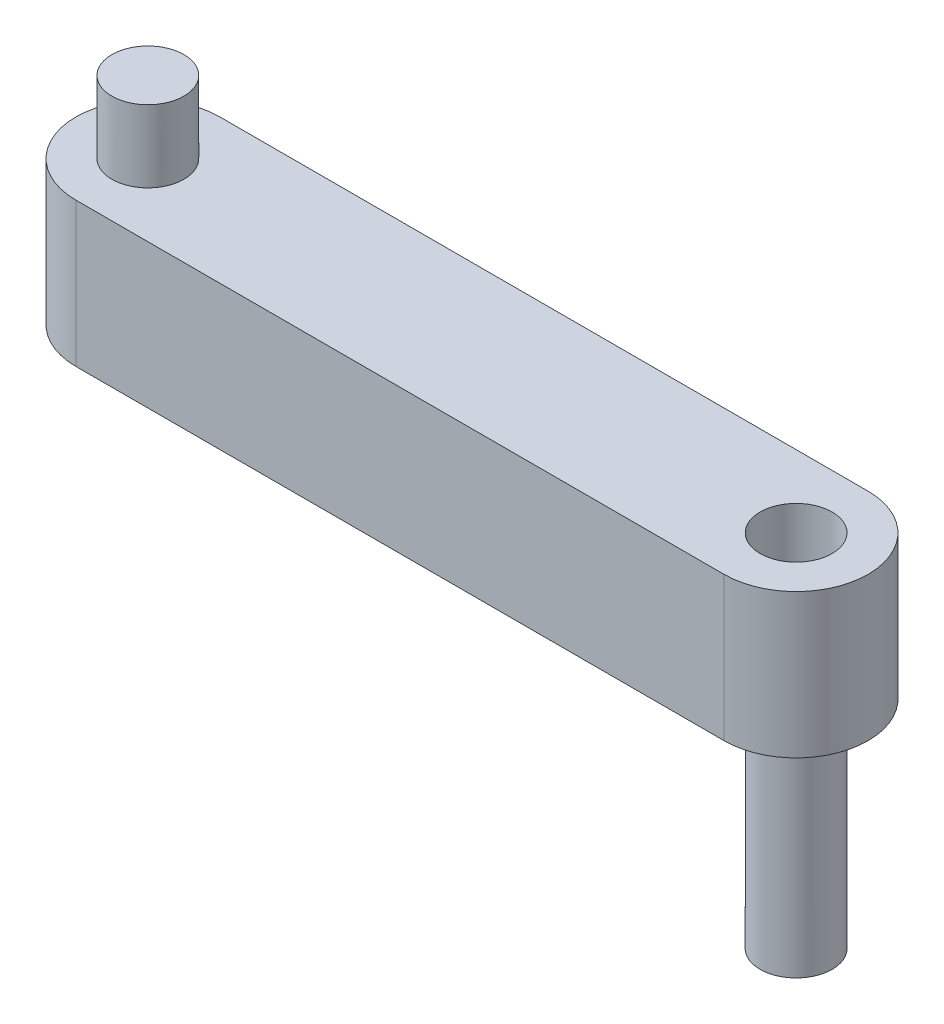
ISO-10303-21;
HEADER;
FILE_DESCRIPTION(('STEP AP214'),'2;1');
FILE_NAME('part.step','',(''),(''),'','','');
FILE_SCHEMA(('AUTOMOTIVE_DESIGN { 1 0 10303 214 1 1 1 1 }'));
ENDSEC;
DATA;
#1=APPLICATION_CONTEXT('core data for automotive mechanical design processes');
#2=APPLICATION_PROTOCOL_DEFINITION('international standard','automotive_design',2000,#1);
#3=PRODUCT_CONTEXT('',#1,'mechanical');
#4=PRODUCT('Part','Part','',(#3));
#5=PRODUCT_RELATED_PRODUCT_CATEGORY('part','',(#4));
#6=PRODUCT_DEFINITION_FORMATION('','',#4);
#7=PRODUCT_DEFINITION_CONTEXT('part definition',#1,'design');
#8=PRODUCT_DEFINITION('design','',#6,#7);
#9=PRODUCT_DEFINITION_SHAPE('','',#8);
#10=(LENGTH_UNIT() NAMED_UNIT(*) SI_UNIT(.MILLI.,.METRE.));
#11=(NAMED_UNIT(*) PLANE_ANGLE_UNIT() SI_UNIT($,.RADIAN.));
#12=(NAMED_UNIT(*) SI_UNIT($,.STERADIAN.) SOLID_ANGLE_UNIT());
#13=UNCERTAINTY_MEASURE_WITH_UNIT(LENGTH_MEASURE(1.E-05),#10,'distance_accuracy_value','');
#14=(GEOMETRIC_REPRESENTATION_CONTEXT(3) GLOBAL_UNCERTAINTY_ASSIGNED_CONTEXT((#13)) GLOBAL_UNIT_ASSIGNED_CONTEXT((#10,
#11,#12)) REPRESENTATION_CONTEXT('',''));
#15=CARTESIAN_POINT('',(0.,0.,0.));
#16=DIRECTION('',(0.,0.,1.));
#17=DIRECTION('',(1.,0.,0.));
#18=AXIS2_PLACEMENT_3D('',#15,#16,#17);
#19=CARTESIAN_POINT('',(-22.5,10.,0.));
#20=DIRECTION('',(0.,-1.,0.));
#21=DIRECTION('',(0.,0.,-1.));
#22=AXIS2_PLACEMENT_3D('',#19,#20,#21);
#23=PLANE('',#22);
#24=CARTESIAN_POINT('',(22.5,10.,0.));
#25=DIRECTION('',(0.,1.,0.));
#26=DIRECTION('',(0.,0.,1.));
#27=AXIS2_PLACEMENT_3D('',#24,#25,#26);
#28=CIRCLE('',#27,2.5);
#29=CARTESIAN_POINT('',(22.5,10.,2.5));
#30=VERTEX_POINT('',#29);
#31=EDGE_CURVE('E252',#30,#30,#28,.T.);
#32=ORIENTED_EDGE('',*,*,#31,.F.);
#33=EDGE_LOOP('',(#32));
#34=FACE_BOUND('',#33,.T.);
#35=CARTESIAN_POINT('',(-22.5,10.,0.));
#36=DIRECTION('',(0.,1.,0.));
#37=DIRECTION('',(0.,0.,-1.));
#38=AXIS2_PLACEMENT_3D('',#35,#36,#37);
#39=CIRCLE('',#38,5.);
#40=CARTESIAN_POINT('',(-22.5,10.,-5.));
#41=VERTEX_POINT('',#40);
#42=CARTESIAN_POINT('',(-22.5,10.,5.));
#43=VERTEX_POINT('',#42);
#44=EDGE_CURVE('E89',#41,#43,#39,.T.);
#45=ORIENTED_EDGE('',*,*,#44,.T.);
#46=DIRECTION('',(1.,0.,0.));
#47=VECTOR('',#46,1.);
#48=CARTESIAN_POINT('',(-22.5,10.,5.));
#49=LINE('',#48,#47);
#50=CARTESIAN_POINT('',(22.5,10.,5.));
#51=VERTEX_POINT('',#50);
#52=EDGE_CURVE('E84',#43,#51,#49,.T.);
#53=ORIENTED_EDGE('',*,*,#52,.T.);
#54=CARTESIAN_POINT('',(22.5,10.,0.));
#55=DIRECTION('',(0.,1.,0.));
#56=DIRECTION('',(0.,0.,1.));
#57=AXIS2_PLACEMENT_3D('',#54,#55,#56);
#58=CIRCLE('',#57,5.);
#59=CARTESIAN_POINT('',(22.5,10.,-5.));
#60=VERTEX_POINT('',#59);
#61=EDGE_CURVE('E87',#51,#60,#58,.T.);
#62=ORIENTED_EDGE('',*,*,#61,.T.);
#63=DIRECTION('',(-1.,0.,0.));
#64=VECTOR('',#63,1.);
#65=CARTESIAN_POINT('',(-22.5,10.,-5.));
#66=LINE('',#65,#64);
#67=EDGE_CURVE('E53',#60,#41,#66,.T.);
#68=ORIENTED_EDGE('',*,*,#67,.T.);
#69=EDGE_LOOP('',(#45,#53,#62,#68));
#70=FACE_BOUND('',#69,.T.);
#71=CARTESIAN_POINT('',(-22.5,10.,0.));
#72=DIRECTION('',(0.,-1.,0.));
#73=DIRECTION('',(0.,0.,-1.));
#74=AXIS2_PLACEMENT_3D('',#71,#72,#73);
#75=CIRCLE('',#74,2.5);
#76=CARTESIAN_POINT('',(-22.5,10.,-2.5));
#77=VERTEX_POINT('',#76);
#78=EDGE_CURVE('E45',#77,#77,#75,.F.);
#79=ORIENTED_EDGE('',*,*,#78,.F.);
#80=EDGE_LOOP('',(#79));
#81=FACE_BOUND('',#80,.T.);
#82=ADVANCED_FACE('F36',(#34,#70,#81),#23,.F.);
#83=CARTESIAN_POINT('',(-22.5,10.,0.));
#84=DIRECTION('',(0.,-1.,0.));
#85=DIRECTION('',(0.,0.,-1.));
#86=AXIS2_PLACEMENT_3D('',#83,#84,#85);
#87=CYLINDRICAL_SURFACE('',#86,5.);
#88=CARTESIAN_POINT('',(-22.5,0.,0.));
#89=DIRECTION('',(0.,1.,0.));
#90=DIRECTION('',(0.,0.,-1.));
#91=AXIS2_PLACEMENT_3D('',#88,#89,#90);
#92=CIRCLE('',#91,5.);
#93=CARTESIAN_POINT('',(-22.5,0.,-5.));
#94=VERTEX_POINT('',#93);
#95=CARTESIAN_POINT('',(-22.5,0.,5.));
#96=VERTEX_POINT('',#95);
#97=EDGE_CURVE('E104',#94,#96,#92,.T.);
#98=ORIENTED_EDGE('',*,*,#97,.T.);
#99=DIRECTION('',(0.,-1.,0.));
#100=VECTOR('',#99,1.);
#101=CARTESIAN_POINT('',(-22.5,10.,5.));
#102=LINE('',#101,#100);
#103=EDGE_CURVE('E95',#43,#96,#102,.T.);
#104=ORIENTED_EDGE('',*,*,#103,.F.);
#105=ORIENTED_EDGE('',*,*,#44,.F.);
#106=DIRECTION('',(0.,-1.,0.));
#107=VECTOR('',#106,1.);
#108=CARTESIAN_POINT('',(-22.5,10.,-5.));
#109=LINE('',#108,#107);
#110=EDGE_CURVE('E100',#41,#94,#109,.T.);
#111=ORIENTED_EDGE('',*,*,#110,.T.);
#112=EDGE_LOOP('',(#98,#104,#105,#111));
#113=FACE_BOUND('',#112,.T.);
#114=ADVANCED_FACE('F38',(#113),#87,.T.);
#115=CARTESIAN_POINT('',(-22.5,10.,5.));
#116=DIRECTION('',(0.,0.,-1.));
#117=DIRECTION('',(-1.,0.,0.));
#118=AXIS2_PLACEMENT_3D('',#115,#116,#117);
#119=PLANE('',#118);
#120=DIRECTION('',(1.,0.,0.));
#121=VECTOR('',#120,1.);
#122=CARTESIAN_POINT('',(-22.5,0.,5.));
#123=LINE('',#122,#121);
#124=CARTESIAN_POINT('',(22.5,0.,5.));
#125=VERTEX_POINT('',#124);
#126=EDGE_CURVE('E94',#96,#125,#123,.T.);
#127=ORIENTED_EDGE('',*,*,#126,.T.);
#128=DIRECTION('',(0.,-1.,0.));
#129=VECTOR('',#128,1.);
#130=CARTESIAN_POINT('',(22.5,10.,5.));
#131=LINE('',#130,#129);
#132=EDGE_CURVE('E92',#51,#125,#131,.T.);
#133=ORIENTED_EDGE('',*,*,#132,.F.);
#134=ORIENTED_EDGE('',*,*,#52,.F.);
#135=ORIENTED_EDGE('',*,*,#103,.T.);
#136=EDGE_LOOP('',(#127,#133,#134,#135));
#137=FACE_BOUND('',#136,.T.);
#138=ADVANCED_FACE('F93',(#137),#119,.F.);
#139=CARTESIAN_POINT('',(22.5,10.,0.));
#140=DIRECTION('',(0.,-1.,0.));
#141=DIRECTION('',(0.,0.,-1.));
#142=AXIS2_PLACEMENT_3D('',#139,#140,#141);
#143=CYLINDRICAL_SURFACE('',#142,5.);
#144=CARTESIAN_POINT('',(22.5,0.,0.));
#145=DIRECTION('',(0.,1.,0.));
#146=DIRECTION('',(0.,0.,1.));
#147=AXIS2_PLACEMENT_3D('',#144,#145,#146);
#148=CIRCLE('',#147,5.);
#149=CARTESIAN_POINT('',(22.5,0.,-5.));
#150=VERTEX_POINT('',#149);
#151=EDGE_CURVE('E70',#125,#150,#148,.T.);
#152=ORIENTED_EDGE('',*,*,#151,.T.);
#153=DIRECTION('',(0.,-1.,0.));
#154=VECTOR('',#153,1.);
#155=CARTESIAN_POINT('',(22.5,10.,-5.));
#156=LINE('',#155,#154);
#157=EDGE_CURVE('E96',#60,#150,#156,.T.);
#158=ORIENTED_EDGE('',*,*,#157,.F.);
#159=ORIENTED_EDGE('',*,*,#61,.F.);
#160=ORIENTED_EDGE('',*,*,#132,.T.);
#161=EDGE_LOOP('',(#152,#158,#159,#160));
#162=FACE_BOUND('',#161,.T.);
#163=ADVANCED_FACE('F98',(#162),#143,.T.);
#164=CARTESIAN_POINT('',(-22.5,10.,-5.));
#165=DIRECTION('',(0.,0.,1.));
#166=DIRECTION('',(1.,0.,0.));
#167=AXIS2_PLACEMENT_3D('',#164,#165,#166);
#168=PLANE('',#167);
#169=DIRECTION('',(-1.,0.,0.));
#170=VECTOR('',#169,1.);
#171=CARTESIAN_POINT('',(-22.5,0.,-5.));
#172=LINE('',#171,#170);
#173=EDGE_CURVE('E76',#150,#94,#172,.T.);
#174=ORIENTED_EDGE('',*,*,#173,.T.);
#175=ORIENTED_EDGE('',*,*,#110,.F.);
#176=ORIENTED_EDGE('',*,*,#67,.F.);
#177=ORIENTED_EDGE('',*,*,#157,.T.);
#178=EDGE_LOOP('',(#174,#175,#176,#177));
#179=FACE_BOUND('',#178,.T.);
#180=ADVANCED_FACE('F131',(#179),#168,.F.);
#181=CARTESIAN_POINT('',(-22.5,0.,0.));
#182=DIRECTION('',(0.,-1.,0.));
#183=DIRECTION('',(0.,0.,-1.));
#184=AXIS2_PLACEMENT_3D('',#181,#182,#183);
#185=PLANE('',#184);
#186=CARTESIAN_POINT('',(-22.5,0.,0.));
#187=DIRECTION('',(0.,-1.,0.));
#188=DIRECTION('',(0.,0.,-1.));
#189=AXIS2_PLACEMENT_3D('',#186,#187,#188);
#190=CIRCLE('',#189,2.5);
#191=CARTESIAN_POINT('',(-22.5,0.,-2.5));
#192=VERTEX_POINT('',#191);
#193=EDGE_CURVE('E251',#192,#192,#190,.T.);
#194=ORIENTED_EDGE('',*,*,#193,.F.);
#195=EDGE_LOOP('',(#194));
#196=FACE_BOUND('',#195,.T.);
#197=CARTESIAN_POINT('',(22.5,0.,0.));
#198=DIRECTION('',(0.,-1.,0.));
#199=DIRECTION('',(0.,0.,-1.));
#200=AXIS2_PLACEMENT_3D('',#197,#198,#199);
#201=CIRCLE('',#200,2.5);
#202=CARTESIAN_POINT('',(22.5,0.,-2.5));
#203=VERTEX_POINT('',#202);
#204=EDGE_CURVE('E11',#203,#203,#201,.T.);
#205=ORIENTED_EDGE('',*,*,#204,.F.);
#206=EDGE_LOOP('',(#205));
#207=FACE_BOUND('',#206,.T.);
#208=ORIENTED_EDGE('',*,*,#97,.F.);
#209=ORIENTED_EDGE('',*,*,#173,.F.);
#210=ORIENTED_EDGE('',*,*,#151,.F.);
#211=ORIENTED_EDGE('',*,*,#126,.F.);
#212=EDGE_LOOP('',(#208,#209,#210,#211));
#213=FACE_BOUND('',#212,.T.);
#214=ADVANCED_FACE('F128',(#196,#207,#213),#185,.T.);
#215=CARTESIAN_POINT('',(-22.5,15.,0.));
#216=DIRECTION('',(0.,-1.,0.));
#217=DIRECTION('',(0.,0.,-1.));
#218=AXIS2_PLACEMENT_3D('',#215,#216,#217);
#219=CYLINDRICAL_SURFACE('',#218,2.5);
#220=CARTESIAN_POINT('',(-22.5,15.,0.));
#221=DIRECTION('',(0.,1.,0.));
#222=DIRECTION('',(0.,0.,1.));
#223=AXIS2_PLACEMENT_3D('',#220,#221,#222);
#224=CIRCLE('',#223,2.5);
#225=CARTESIAN_POINT('',(-22.5,15.,2.5));
#226=VERTEX_POINT('',#225);
#227=EDGE_CURVE('E107',#226,#226,#224,.T.);
#228=ORIENTED_EDGE('',*,*,#227,.F.);
#229=EDGE_LOOP('',(#228));
#230=FACE_BOUND('',#229,.T.);
#231=ORIENTED_EDGE('',*,*,#78,.T.);
#232=EDGE_LOOP('',(#231));
#233=FACE_BOUND('',#232,.T.);
#234=ADVANCED_FACE('F116',(#230,#233),#219,.T.);
#235=CARTESIAN_POINT('',(-22.5,15.,0.));
#236=DIRECTION('',(0.,1.,0.));
#237=DIRECTION('',(0.,0.,1.));
#238=AXIS2_PLACEMENT_3D('',#235,#236,#237);
#239=PLANE('',#238);
#240=ORIENTED_EDGE('',*,*,#227,.T.);
#241=EDGE_LOOP('',(#240));
#242=FACE_BOUND('',#241,.T.);
#243=ADVANCED_FACE('F161',(#242),#239,.T.);
#244=CARTESIAN_POINT('',(22.5,-15.,0.));
#245=DIRECTION('',(0.,1.,0.));
#246=DIRECTION('',(0.,0.,1.));
#247=AXIS2_PLACEMENT_3D('',#244,#245,#246);
#248=CYLINDRICAL_SURFACE('',#247,2.5);
#249=ORIENTED_EDGE('',*,*,#204,.T.);
#250=EDGE_LOOP('',(#249));
#251=FACE_BOUND('',#250,.T.);
#252=CARTESIAN_POINT('',(22.5,-15.,0.));
#253=DIRECTION('',(0.,1.,0.));
#254=DIRECTION('',(0.,0.,1.));
#255=AXIS2_PLACEMENT_3D('',#252,#253,#254);
#256=CIRCLE('',#255,2.5);
#257=CARTESIAN_POINT('',(22.5,-15.,2.5));
#258=VERTEX_POINT('',#257);
#259=EDGE_CURVE('E261',#258,#258,#256,.T.);
#260=ORIENTED_EDGE('',*,*,#259,.T.);
#261=EDGE_LOOP('',(#260));
#262=FACE_BOUND('',#261,.T.);
#263=ADVANCED_FACE('F168',(#251,#262),#248,.T.);
#264=CARTESIAN_POINT('',(22.5,-15.,0.));
#265=DIRECTION('',(0.,1.,0.));
#266=DIRECTION('',(0.,0.,1.));
#267=AXIS2_PLACEMENT_3D('',#264,#265,#266);
#268=PLANE('',#267);
#269=ORIENTED_EDGE('',*,*,#259,.F.);
#270=EDGE_LOOP('',(#269));
#271=FACE_BOUND('',#270,.T.);
#272=ADVANCED_FACE('F175',(#271),#268,.F.);
#273=CARTESIAN_POINT('',(-22.5,5.,0.));
#274=DIRECTION('',(0.,-1.,0.));
#275=DIRECTION('',(0.,0.,-1.));
#276=AXIS2_PLACEMENT_3D('',#273,#274,#275);
#277=CYLINDRICAL_SURFACE('',#276,2.5);
#278=CARTESIAN_POINT('',(-22.5,5.,0.));
#279=DIRECTION('',(0.,-1.,0.));
#280=DIRECTION('',(0.,0.,-1.));
#281=AXIS2_PLACEMENT_3D('',#278,#279,#280);
#282=CIRCLE('',#281,2.5);
#283=CARTESIAN_POINT('',(-22.5,5.,-2.5));
#284=VERTEX_POINT('',#283);
#285=EDGE_CURVE('E255',#284,#284,#282,.T.);
#286=ORIENTED_EDGE('',*,*,#285,.F.);
#287=EDGE_LOOP('',(#286));
#288=FACE_BOUND('',#287,.T.);
#289=ORIENTED_EDGE('',*,*,#193,.T.);
#290=EDGE_LOOP('',(#289));
#291=FACE_BOUND('',#290,.T.);
#292=ADVANCED_FACE('F182',(#288,#291),#277,.F.);
#293=CARTESIAN_POINT('',(-22.5,5.,0.));
#294=DIRECTION('',(0.,-1.,0.));
#295=DIRECTION('',(0.,0.,-1.));
#296=AXIS2_PLACEMENT_3D('',#293,#294,#295);
#297=PLANE('',#296);
#298=ORIENTED_EDGE('',*,*,#285,.T.);
#299=EDGE_LOOP('',(#298));
#300=FACE_BOUND('',#299,.T.);
#301=ADVANCED_FACE('F189',(#300),#297,.T.);
#302=CARTESIAN_POINT('',(22.5,5.,0.));
#303=DIRECTION('',(0.,1.,0.));
#304=DIRECTION('',(0.,0.,1.));
#305=AXIS2_PLACEMENT_3D('',#302,#303,#304);
#306=CYLINDRICAL_SURFACE('',#305,2.5);
#307=CARTESIAN_POINT('',(22.5,5.,0.));
#308=DIRECTION('',(0.,1.,0.));
#309=DIRECTION('',(0.,0.,1.));
#310=AXIS2_PLACEMENT_3D('',#307,#308,#309);
#311=CIRCLE('',#310,2.5);
#312=CARTESIAN_POINT('',(22.5,5.,2.5));
#313=VERTEX_POINT('',#312);
#314=EDGE_CURVE('E250',#313,#313,#311,.T.);
#315=ORIENTED_EDGE('',*,*,#314,.F.);
#316=EDGE_LOOP('',(#315));
#317=FACE_BOUND('',#316,.T.);
#318=ORIENTED_EDGE('',*,*,#31,.T.);
#319=EDGE_LOOP('',(#318));
#320=FACE_BOUND('',#319,.T.);
#321=ADVANCED_FACE('F197',(#317,#320),#306,.F.);
#322=CARTESIAN_POINT('',(22.5,5.,0.));
#323=DIRECTION('',(0.,1.,0.));
#324=DIRECTION('',(0.,0.,1.));
#325=AXIS2_PLACEMENT_3D('',#322,#323,#324);
#326=PLANE('',#325);
#327=ORIENTED_EDGE('',*,*,#314,.T.);
#328=EDGE_LOOP('',(#327));
#329=FACE_BOUND('',#328,.T.);
#330=ADVANCED_FACE('F205',(#329),#326,.T.);
#331=CLOSED_SHELL('',(#82,#114,#138,#163,#180,#214,#234,#243,#263,#272,#292,#301,#321,#330));
#332=MANIFOLD_SOLID_BREP('B2',#331);
#333=ADVANCED_BREP_SHAPE_REPRESENTATION('',(#18,#332),#14);
#334=SHAPE_DEFINITION_REPRESENTATION(#9,#333);
ENDSEC;
END-ISO-10303-21;
